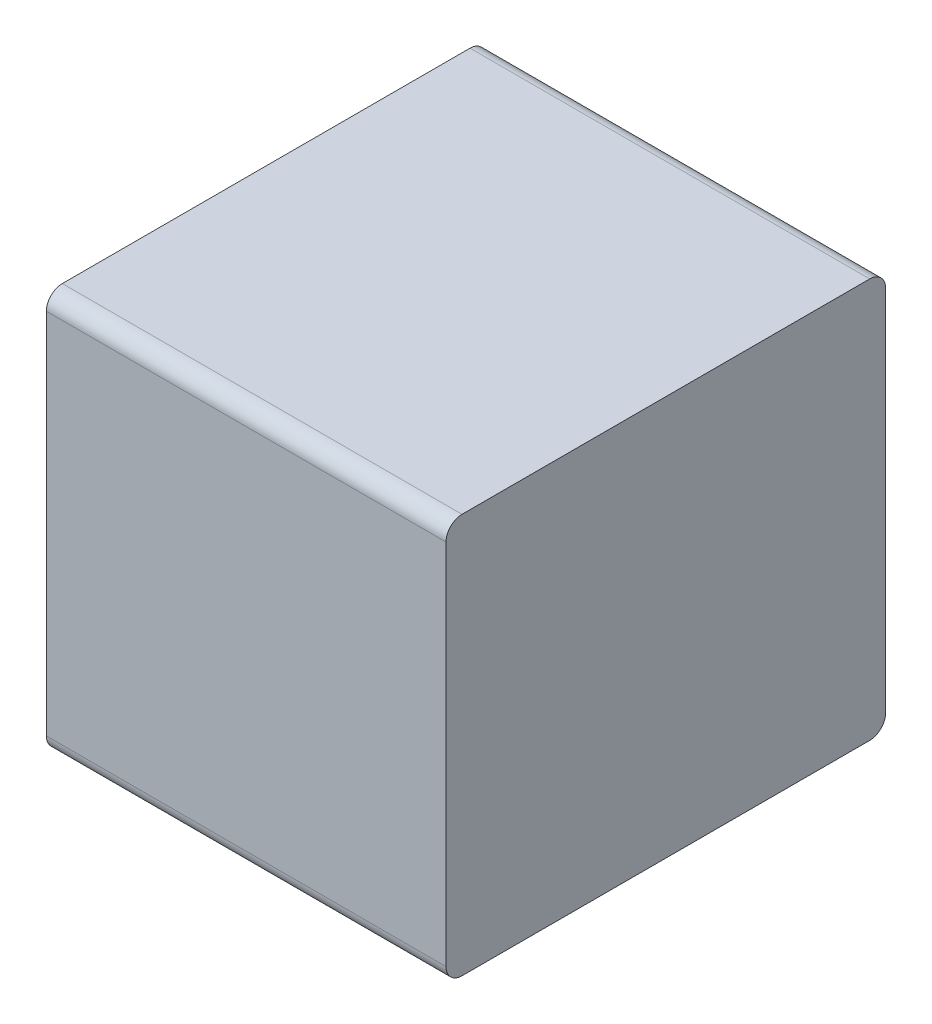
ISO-10303-21;
HEADER;
FILE_DESCRIPTION(('STEP AP214'),'2;1');
FILE_NAME('part.step','',(''),(''),'','','');
FILE_SCHEMA(('AUTOMOTIVE_DESIGN { 1 0 10303 214 1 1 1 1 }'));
ENDSEC;
DATA;
#1=APPLICATION_CONTEXT('core data for automotive mechanical design processes');
#2=APPLICATION_PROTOCOL_DEFINITION('international standard','automotive_design',2000,#1);
#3=PRODUCT_CONTEXT('',#1,'mechanical');
#4=PRODUCT('Part','Part','',(#3));
#5=PRODUCT_RELATED_PRODUCT_CATEGORY('part','',(#4));
#6=PRODUCT_DEFINITION_FORMATION('','',#4);
#7=PRODUCT_DEFINITION_CONTEXT('part definition',#1,'design');
#8=PRODUCT_DEFINITION('design','',#6,#7);
#9=PRODUCT_DEFINITION_SHAPE('','',#8);
#10=(LENGTH_UNIT() NAMED_UNIT(*) SI_UNIT(.MILLI.,.METRE.));
#11=(NAMED_UNIT(*) PLANE_ANGLE_UNIT() SI_UNIT($,.RADIAN.));
#12=(NAMED_UNIT(*) SI_UNIT($,.STERADIAN.) SOLID_ANGLE_UNIT());
#13=UNCERTAINTY_MEASURE_WITH_UNIT(LENGTH_MEASURE(1.E-05),#10,'distance_accuracy_value','');
#14=(GEOMETRIC_REPRESENTATION_CONTEXT(3) GLOBAL_UNCERTAINTY_ASSIGNED_CONTEXT((#13)) GLOBAL_UNIT_ASSIGNED_CONTEXT((#10,
#11,#12)) REPRESENTATION_CONTEXT('',''));
#15=CARTESIAN_POINT('',(0.,0.,0.));
#16=DIRECTION('',(0.,0.,1.));
#17=DIRECTION('',(1.,0.,0.));
#18=AXIS2_PLACEMENT_3D('',#15,#16,#17);
#19=CARTESIAN_POINT('',(0.125,0.23,0.02));
#20=DIRECTION('',(1.,0.,0.));
#21=DIRECTION('',(0.,0.707106781186548,-0.707106781186547));
#22=AXIS2_PLACEMENT_3D('',#19,#20,#21);
#23=CYLINDRICAL_SURFACE('',#22,0.02);
#24=CARTESIAN_POINT('',(0.25,0.23,0.02));
#25=DIRECTION('',(-1.,0.,0.));
#26=DIRECTION('',(0.,0.707106781186548,-0.707106781186547));
#27=AXIS2_PLACEMENT_3D('',#24,#25,#26);
#28=CIRCLE('',#27,0.02);
#29=CARTESIAN_POINT('',(0.25,0.25,0.02));
#30=VERTEX_POINT('',#29);
#31=CARTESIAN_POINT('',(0.25,0.23,0.));
#32=VERTEX_POINT('',#31);
#33=EDGE_CURVE('E11',#30,#32,#28,.T.);
#34=ORIENTED_EDGE('',*,*,#33,.T.);
#35=DIRECTION('',(-1.,0.,0.));
#36=VECTOR('',#35,1.);
#37=CARTESIAN_POINT('',(0.125,0.23,0.));
#38=LINE('',#37,#36);
#39=CARTESIAN_POINT('',(-0.25,0.23,0.));
#40=VERTEX_POINT('',#39);
#41=EDGE_CURVE('E24',#32,#40,#38,.T.);
#42=ORIENTED_EDGE('',*,*,#41,.T.);
#43=CARTESIAN_POINT('',(-0.25,0.23,0.02));
#44=DIRECTION('',(1.,0.,0.));
#45=DIRECTION('',(0.,0.707106781186548,-0.707106781186547));
#46=AXIS2_PLACEMENT_3D('',#43,#44,#45);
#47=CIRCLE('',#46,0.02);
#48=CARTESIAN_POINT('',(-0.25,0.25,0.02));
#49=VERTEX_POINT('',#48);
#50=EDGE_CURVE('E142',#40,#49,#47,.T.);
#51=ORIENTED_EDGE('',*,*,#50,.T.);
#52=DIRECTION('',(1.,0.,0.));
#53=VECTOR('',#52,1.);
#54=CARTESIAN_POINT('',(0.125,0.25,0.02));
#55=LINE('',#54,#53);
#56=EDGE_CURVE('E140',#49,#30,#55,.T.);
#57=ORIENTED_EDGE('',*,*,#56,.T.);
#58=EDGE_LOOP('',(#34,#42,#51,#57));
#59=FACE_BOUND('',#58,.T.);
#60=ADVANCED_FACE('F17',(#59),#23,.T.);
#61=CARTESIAN_POINT('',(0.25,0.25,0.));
#62=DIRECTION('',(0.,1.,0.));
#63=DIRECTION('',(-1.,0.,0.));
#64=AXIS2_PLACEMENT_3D('',#61,#62,#63);
#65=PLANE('',#64);
#66=ORIENTED_EDGE('',*,*,#56,.F.);
#67=DIRECTION('',(0.,0.,1.));
#68=VECTOR('',#67,1.);
#69=CARTESIAN_POINT('',(-0.25,0.25,0.));
#70=LINE('',#69,#68);
#71=CARTESIAN_POINT('',(-0.25,0.25,0.53));
#72=VERTEX_POINT('',#71);
#73=EDGE_CURVE('E138',#49,#72,#70,.T.);
#74=ORIENTED_EDGE('',*,*,#73,.T.);
#75=DIRECTION('',(-1.,0.,0.));
#76=VECTOR('',#75,1.);
#77=CARTESIAN_POINT('',(0.125,0.25,0.53));
#78=LINE('',#77,#76);
#79=CARTESIAN_POINT('',(0.25,0.25,0.53));
#80=VERTEX_POINT('',#79);
#81=EDGE_CURVE('E135',#80,#72,#78,.T.);
#82=ORIENTED_EDGE('',*,*,#81,.F.);
#83=DIRECTION('',(0.,0.,1.));
#84=VECTOR('',#83,1.);
#85=CARTESIAN_POINT('',(0.25,0.25,0.));
#86=LINE('',#85,#84);
#87=EDGE_CURVE('E133',#30,#80,#86,.T.);
#88=ORIENTED_EDGE('',*,*,#87,.F.);
#89=EDGE_LOOP('',(#66,#74,#82,#88));
#90=FACE_BOUND('',#89,.T.);
#91=ADVANCED_FACE('F163',(#90),#65,.T.);
#92=CARTESIAN_POINT('',(-0.25,0.25,0.));
#93=DIRECTION('',(-1.,0.,0.));
#94=DIRECTION('',(0.,-1.,0.));
#95=AXIS2_PLACEMENT_3D('',#92,#93,#94);
#96=PLANE('',#95);
#97=ORIENTED_EDGE('',*,*,#50,.F.);
#98=DIRECTION('',(0.,1.,0.));
#99=VECTOR('',#98,1.);
#100=CARTESIAN_POINT('',(-0.25,-0.25,0.));
#101=LINE('',#100,#99);
#102=CARTESIAN_POINT('',(-0.25,-0.23,0.));
#103=VERTEX_POINT('',#102);
#104=EDGE_CURVE('E130',#103,#40,#101,.T.);
#105=ORIENTED_EDGE('',*,*,#104,.F.);
#106=CARTESIAN_POINT('',(-0.25,-0.23,0.02));
#107=DIRECTION('',(1.,0.,0.));
#108=DIRECTION('',(0.,-0.707106781186548,-0.707106781186547));
#109=AXIS2_PLACEMENT_3D('',#106,#107,#108);
#110=CIRCLE('',#109,0.02);
#111=CARTESIAN_POINT('',(-0.25,-0.25,0.02));
#112=VERTEX_POINT('',#111);
#113=EDGE_CURVE('E127',#112,#103,#110,.T.);
#114=ORIENTED_EDGE('',*,*,#113,.F.);
#115=DIRECTION('',(0.,0.,1.));
#116=VECTOR('',#115,1.);
#117=CARTESIAN_POINT('',(-0.25,-0.25,0.));
#118=LINE('',#117,#116);
#119=CARTESIAN_POINT('',(-0.25,-0.25,0.53));
#120=VERTEX_POINT('',#119);
#121=EDGE_CURVE('E125',#112,#120,#118,.T.);
#122=ORIENTED_EDGE('',*,*,#121,.T.);
#123=CARTESIAN_POINT('',(-0.25,-0.23,0.53));
#124=DIRECTION('',(1.,0.,0.));
#125=DIRECTION('',(0.,-0.707106781186548,0.707106781186548));
#126=AXIS2_PLACEMENT_3D('',#123,#124,#125);
#127=CIRCLE('',#126,0.02);
#128=CARTESIAN_POINT('',(-0.25,-0.23,0.55));
#129=VERTEX_POINT('',#128);
#130=EDGE_CURVE('E123',#129,#120,#127,.T.);
#131=ORIENTED_EDGE('',*,*,#130,.F.);
#132=DIRECTION('',(0.,-1.,0.));
#133=VECTOR('',#132,1.);
#134=CARTESIAN_POINT('',(-0.25,-0.25,0.55));
#135=LINE('',#134,#133);
#136=CARTESIAN_POINT('',(-0.25,0.23,0.55));
#137=VERTEX_POINT('',#136);
#138=EDGE_CURVE('E101',#137,#129,#135,.T.);
#139=ORIENTED_EDGE('',*,*,#138,.F.);
#140=CARTESIAN_POINT('',(-0.25,0.23,0.53));
#141=DIRECTION('',(1.,0.,0.));
#142=DIRECTION('',(0.,0.707106781186548,0.707106781186548));
#143=AXIS2_PLACEMENT_3D('',#140,#141,#142);
#144=CIRCLE('',#143,0.02);
#145=EDGE_CURVE('E119',#72,#137,#144,.T.);
#146=ORIENTED_EDGE('',*,*,#145,.F.);
#147=ORIENTED_EDGE('',*,*,#73,.F.);
#148=EDGE_LOOP('',(#97,#105,#114,#122,#131,#139,#146,#147));
#149=FACE_BOUND('',#148,.T.);
#150=ADVANCED_FACE('F148',(#149),#96,.T.);
#151=CARTESIAN_POINT('',(-0.125,-0.23,0.02));
#152=DIRECTION('',(-1.,0.,0.));
#153=DIRECTION('',(0.,-0.707106781186548,-0.707106781186547));
#154=AXIS2_PLACEMENT_3D('',#151,#152,#153);
#155=CYLINDRICAL_SURFACE('',#154,0.02);
#156=ORIENTED_EDGE('',*,*,#113,.T.);
#157=DIRECTION('',(1.,0.,0.));
#158=VECTOR('',#157,1.);
#159=CARTESIAN_POINT('',(-0.125,-0.23,0.));
#160=LINE('',#159,#158);
#161=CARTESIAN_POINT('',(0.25,-0.23,0.));
#162=VERTEX_POINT('',#161);
#163=EDGE_CURVE('E117',#103,#162,#160,.T.);
#164=ORIENTED_EDGE('',*,*,#163,.T.);
#165=CARTESIAN_POINT('',(0.25,-0.23,0.02));
#166=DIRECTION('',(-1.,0.,0.));
#167=DIRECTION('',(0.,-0.707106781186548,-0.707106781186547));
#168=AXIS2_PLACEMENT_3D('',#165,#166,#167);
#169=CIRCLE('',#168,0.02);
#170=CARTESIAN_POINT('',(0.25,-0.25,0.02));
#171=VERTEX_POINT('',#170);
#172=EDGE_CURVE('E115',#162,#171,#169,.T.);
#173=ORIENTED_EDGE('',*,*,#172,.T.);
#174=DIRECTION('',(-1.,0.,0.));
#175=VECTOR('',#174,1.);
#176=CARTESIAN_POINT('',(-0.125,-0.25,0.02));
#177=LINE('',#176,#175);
#178=EDGE_CURVE('E112',#171,#112,#177,.T.);
#179=ORIENTED_EDGE('',*,*,#178,.T.);
#180=EDGE_LOOP('',(#156,#164,#173,#179));
#181=FACE_BOUND('',#180,.T.);
#182=ADVANCED_FACE('F154',(#181),#155,.T.);
#183=CARTESIAN_POINT('',(-0.25,-0.25,0.));
#184=DIRECTION('',(0.,-1.,0.));
#185=DIRECTION('',(1.,0.,0.));
#186=AXIS2_PLACEMENT_3D('',#183,#184,#185);
#187=PLANE('',#186);
#188=ORIENTED_EDGE('',*,*,#178,.F.);
#189=DIRECTION('',(0.,0.,1.));
#190=VECTOR('',#189,1.);
#191=CARTESIAN_POINT('',(0.25,-0.25,0.));
#192=LINE('',#191,#190);
#193=CARTESIAN_POINT('',(0.25,-0.25,0.53));
#194=VERTEX_POINT('',#193);
#195=EDGE_CURVE('E110',#171,#194,#192,.T.);
#196=ORIENTED_EDGE('',*,*,#195,.T.);
#197=DIRECTION('',(1.,0.,0.));
#198=VECTOR('',#197,1.);
#199=CARTESIAN_POINT('',(-0.125,-0.25,0.53));
#200=LINE('',#199,#198);
#201=EDGE_CURVE('E96',#120,#194,#200,.T.);
#202=ORIENTED_EDGE('',*,*,#201,.F.);
#203=ORIENTED_EDGE('',*,*,#121,.F.);
#204=EDGE_LOOP('',(#188,#196,#202,#203));
#205=FACE_BOUND('',#204,.T.);
#206=ADVANCED_FACE('F157',(#205),#187,.T.);
#207=CARTESIAN_POINT('',(0.25,-0.25,0.));
#208=DIRECTION('',(1.,0.,0.));
#209=DIRECTION('',(0.,1.,0.));
#210=AXIS2_PLACEMENT_3D('',#207,#208,#209);
#211=PLANE('',#210);
#212=ORIENTED_EDGE('',*,*,#33,.F.);
#213=ORIENTED_EDGE('',*,*,#87,.T.);
#214=CARTESIAN_POINT('',(0.25,0.23,0.53));
#215=DIRECTION('',(-1.,0.,0.));
#216=DIRECTION('',(0.,0.707106781186548,0.707106781186548));
#217=AXIS2_PLACEMENT_3D('',#214,#215,#216);
#218=CIRCLE('',#217,0.02);
#219=CARTESIAN_POINT('',(0.25,0.23,0.55));
#220=VERTEX_POINT('',#219);
#221=EDGE_CURVE('E83',#220,#80,#218,.T.);
#222=ORIENTED_EDGE('',*,*,#221,.F.);
#223=DIRECTION('',(0.,1.,0.));
#224=VECTOR('',#223,1.);
#225=CARTESIAN_POINT('',(0.25,0.25,0.55));
#226=LINE('',#225,#224);
#227=CARTESIAN_POINT('',(0.25,-0.23,0.55));
#228=VERTEX_POINT('',#227);
#229=EDGE_CURVE('E77',#228,#220,#226,.T.);
#230=ORIENTED_EDGE('',*,*,#229,.F.);
#231=CARTESIAN_POINT('',(0.25,-0.23,0.53));
#232=DIRECTION('',(-1.,0.,0.));
#233=DIRECTION('',(0.,-0.707106781186548,0.707106781186548));
#234=AXIS2_PLACEMENT_3D('',#231,#232,#233);
#235=CIRCLE('',#234,0.02);
#236=EDGE_CURVE('E81',#194,#228,#235,.T.);
#237=ORIENTED_EDGE('',*,*,#236,.F.);
#238=ORIENTED_EDGE('',*,*,#195,.F.);
#239=ORIENTED_EDGE('',*,*,#172,.F.);
#240=DIRECTION('',(0.,-1.,0.));
#241=VECTOR('',#240,1.);
#242=CARTESIAN_POINT('',(0.25,0.25,0.));
#243=LINE('',#242,#241);
#244=EDGE_CURVE('E97',#32,#162,#243,.T.);
#245=ORIENTED_EDGE('',*,*,#244,.F.);
#246=EDGE_LOOP('',(#212,#213,#222,#230,#237,#238,#239,#245));
#247=FACE_BOUND('',#246,.T.);
#248=ADVANCED_FACE('F79',(#247),#211,.T.);
#249=CARTESIAN_POINT('',(0.125,0.23,0.53));
#250=DIRECTION('',(-1.,0.,0.));
#251=DIRECTION('',(0.,0.707106781186548,0.707106781186548));
#252=AXIS2_PLACEMENT_3D('',#249,#250,#251);
#253=CYLINDRICAL_SURFACE('',#252,0.02);
#254=ORIENTED_EDGE('',*,*,#145,.T.);
#255=DIRECTION('',(1.,0.,0.));
#256=VECTOR('',#255,1.);
#257=CARTESIAN_POINT('',(0.125,0.23,0.55));
#258=LINE('',#257,#256);
#259=EDGE_CURVE('E102',#137,#220,#258,.T.);
#260=ORIENTED_EDGE('',*,*,#259,.T.);
#261=ORIENTED_EDGE('',*,*,#221,.T.);
#262=ORIENTED_EDGE('',*,*,#81,.T.);
#263=EDGE_LOOP('',(#254,#260,#261,#262));
#264=FACE_BOUND('',#263,.T.);
#265=ADVANCED_FACE('F160',(#264),#253,.T.);
#266=CARTESIAN_POINT('',(0.,0.,0.55));
#267=DIRECTION('',(0.,0.,1.));
#268=DIRECTION('',(1.,0.,0.));
#269=AXIS2_PLACEMENT_3D('',#266,#267,#268);
#270=PLANE('',#269);
#271=ORIENTED_EDGE('',*,*,#259,.F.);
#272=ORIENTED_EDGE('',*,*,#138,.T.);
#273=DIRECTION('',(-1.,0.,0.));
#274=VECTOR('',#273,1.);
#275=CARTESIAN_POINT('',(-0.125,-0.23,0.55));
#276=LINE('',#275,#274);
#277=EDGE_CURVE('E94',#228,#129,#276,.T.);
#278=ORIENTED_EDGE('',*,*,#277,.F.);
#279=ORIENTED_EDGE('',*,*,#229,.T.);
#280=EDGE_LOOP('',(#271,#272,#278,#279));
#281=FACE_BOUND('',#280,.T.);
#282=ADVANCED_FACE('F100',(#281),#270,.T.);
#283=CARTESIAN_POINT('',(-0.125,-0.23,0.53));
#284=DIRECTION('',(1.,0.,0.));
#285=DIRECTION('',(0.,-0.707106781186548,0.707106781186548));
#286=AXIS2_PLACEMENT_3D('',#283,#284,#285);
#287=CYLINDRICAL_SURFACE('',#286,0.02);
#288=ORIENTED_EDGE('',*,*,#236,.T.);
#289=ORIENTED_EDGE('',*,*,#277,.T.);
#290=ORIENTED_EDGE('',*,*,#130,.T.);
#291=ORIENTED_EDGE('',*,*,#201,.T.);
#292=EDGE_LOOP('',(#288,#289,#290,#291));
#293=FACE_BOUND('',#292,.T.);
#294=ADVANCED_FACE('F92',(#293),#287,.T.);
#295=CARTESIAN_POINT('',(0.,0.,0.));
#296=DIRECTION('',(0.,0.,1.));
#297=DIRECTION('',(1.,0.,0.));
#298=AXIS2_PLACEMENT_3D('',#295,#296,#297);
#299=PLANE('',#298);
#300=ORIENTED_EDGE('',*,*,#41,.F.);
#301=ORIENTED_EDGE('',*,*,#244,.T.);
#302=ORIENTED_EDGE('',*,*,#163,.F.);
#303=ORIENTED_EDGE('',*,*,#104,.T.);
#304=EDGE_LOOP('',(#300,#301,#302,#303));
#305=FACE_BOUND('',#304,.T.);
#306=ADVANCED_FACE('F151',(#305),#299,.F.);
#307=CLOSED_SHELL('',(#60,#91,#150,#182,#206,#248,#265,#282,#294,#306));
#308=MANIFOLD_SOLID_BREP('B1',#307);
#309=ADVANCED_BREP_SHAPE_REPRESENTATION('',(#18,#308),#14);
#310=SHAPE_DEFINITION_REPRESENTATION(#9,#309);
ENDSEC;
END-ISO-10303-21;
